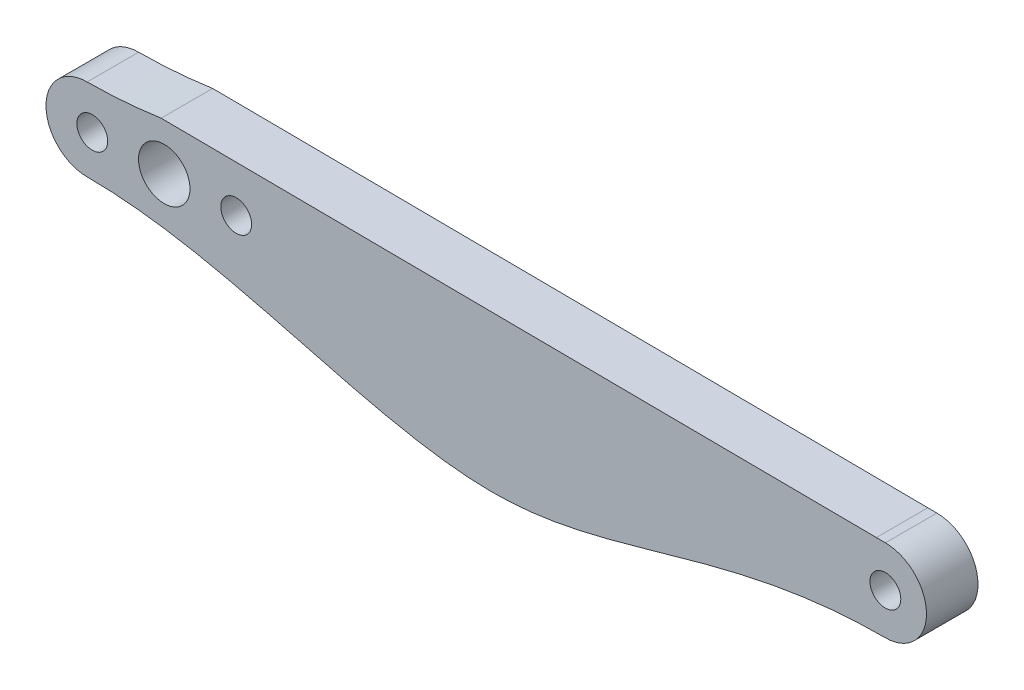
ISO-10303-21;
HEADER;
FILE_DESCRIPTION(('STEP AP214'),'2;1');
FILE_NAME('part.step','',(''),(''),'','','');
FILE_SCHEMA(('AUTOMOTIVE_DESIGN { 1 0 10303 214 1 1 1 1 }'));
ENDSEC;
DATA;
#1=APPLICATION_CONTEXT('core data for automotive mechanical design processes');
#2=APPLICATION_PROTOCOL_DEFINITION('international standard','automotive_design',2000,#1);
#3=PRODUCT_CONTEXT('',#1,'mechanical');
#4=PRODUCT('Part','Part','',(#3));
#5=PRODUCT_RELATED_PRODUCT_CATEGORY('part','',(#4));
#6=PRODUCT_DEFINITION_FORMATION('','',#4);
#7=PRODUCT_DEFINITION_CONTEXT('part definition',#1,'design');
#8=PRODUCT_DEFINITION('design','',#6,#7);
#9=PRODUCT_DEFINITION_SHAPE('','',#8);
#10=(LENGTH_UNIT() NAMED_UNIT(*) SI_UNIT(.MILLI.,.METRE.));
#11=(NAMED_UNIT(*) PLANE_ANGLE_UNIT() SI_UNIT($,.RADIAN.));
#12=(NAMED_UNIT(*) SI_UNIT($,.STERADIAN.) SOLID_ANGLE_UNIT());
#13=UNCERTAINTY_MEASURE_WITH_UNIT(LENGTH_MEASURE(1.E-05),#10,'distance_accuracy_value','');
#14=(GEOMETRIC_REPRESENTATION_CONTEXT(3) GLOBAL_UNCERTAINTY_ASSIGNED_CONTEXT((#13)) GLOBAL_UNIT_ASSIGNED_CONTEXT((#10,
#11,#12)) REPRESENTATION_CONTEXT('',''));
#15=CARTESIAN_POINT('',(0.,0.,0.));
#16=DIRECTION('',(0.,0.,1.));
#17=DIRECTION('',(1.,0.,0.));
#18=AXIS2_PLACEMENT_3D('',#15,#16,#17);
#19=CARTESIAN_POINT('',(0.,4.,5.01));
#20=CARTESIAN_POINT('',(-15.820527041139,3.99999999999999,5.01));
#21=CARTESIAN_POINT('',(-37.0419692548758,17.7090599753551,5.01));
#22=CARTESIAN_POINT('',(-63.5275616786056,4.,5.01));
#23=CARTESIAN_POINT('',(-77.64,4.,5.01));
#24=B_SPLINE_CURVE_WITH_KNOTS('',3,(#19,#20,#21,#22,#23),.UNSPECIFIED.,.F.,.F.,(4,1,4),(0.,
0.485752691256626,1.),.UNSPECIFIED.);
#25=DIRECTION('',(0.,0.,-1.));
#26=VECTOR('',#25,1.);
#27=SURFACE_OF_LINEAR_EXTRUSION('',#24,#26);
#28=CARTESIAN_POINT('',(-77.64,4.,0.));
#29=CARTESIAN_POINT('',(-63.5275616786056,4.,0.));
#30=CARTESIAN_POINT('',(-37.0419692548758,17.7090599753551,0.));
#31=CARTESIAN_POINT('',(-15.820527041139,3.99999999999999,0.));
#32=CARTESIAN_POINT('',(0.,4.,0.));
#33=B_SPLINE_CURVE_WITH_KNOTS('',3,(#28,#29,#30,#31,#32),.UNSPECIFIED.,.F.,.F.,(4,1,4),(0.,
0.514247308743374,1.),.UNSPECIFIED.);
#34=CARTESIAN_POINT('',(-0.876672071103358,4.0068201978836,0.));
#35=VERTEX_POINT('',#34);
#36=CARTESIAN_POINT('',(0.,4.,0.));
#37=VERTEX_POINT('',#36);
#38=EDGE_CURVE('E108',#35,#37,#33,.T.);
#39=ORIENTED_EDGE('',*,*,#38,.F.);
#40=DIRECTION('',(0.,0.,1.));
#41=VECTOR('',#40,1.);
#42=CARTESIAN_POINT('',(-0.876672071103358,4.0068201978836,-4.99));
#43=LINE('',#42,#41);
#44=CARTESIAN_POINT('',(-0.876672071103358,4.0068201978836,5.01));
#45=VERTEX_POINT('',#44);
#46=EDGE_CURVE('E96',#35,#45,#43,.T.);
#47=ORIENTED_EDGE('',*,*,#46,.T.);
#48=CARTESIAN_POINT('',(0.,4.,5.01));
#49=VERTEX_POINT('',#48);
#50=EDGE_CURVE('E107',#49,#45,#24,.T.);
#51=ORIENTED_EDGE('',*,*,#50,.F.);
#52=DIRECTION('',(0.,0.,-1.));
#53=VECTOR('',#52,1.);
#54=CARTESIAN_POINT('',(0.,4.,5.));
#55=LINE('',#54,#53);
#56=EDGE_CURVE('E11',#49,#37,#55,.T.);
#57=ORIENTED_EDGE('',*,*,#56,.T.);
#58=EDGE_LOOP('',(#39,#47,#51,#57));
#59=FACE_BOUND('',#58,.T.);
#60=ADVANCED_FACE('F41',(#59),#27,.F.);
#61=CARTESIAN_POINT('',(0.,0.,0.));
#62=DIRECTION('',(0.,0.,1.));
#63=DIRECTION('',(1.,0.,0.));
#64=AXIS2_PLACEMENT_3D('',#61,#62,#63);
#65=PLANE('',#64);
#66=CARTESIAN_POINT('',(-77.14,0.,0.));
#67=DIRECTION('',(0.,0.,1.));
#68=DIRECTION('',(1.,0.,0.));
#69=AXIS2_PLACEMENT_3D('',#66,#67,#68);
#70=CIRCLE('',#69,1.5);
#71=CARTESIAN_POINT('',(-75.64,0.,0.));
#72=VERTEX_POINT('',#71);
#73=EDGE_CURVE('E102',#72,#72,#70,.T.);
#74=ORIENTED_EDGE('',*,*,#73,.T.);
#75=EDGE_LOOP('',(#74));
#76=FACE_BOUND('',#75,.T.);
#77=CARTESIAN_POINT('',(-63.14,0.,0.));
#78=DIRECTION('',(0.,0.,1.));
#79=DIRECTION('',(1.,0.,0.));
#80=AXIS2_PLACEMENT_3D('',#77,#78,#79);
#81=CIRCLE('',#80,1.5);
#82=CARTESIAN_POINT('',(-61.64,0.,0.));
#83=VERTEX_POINT('',#82);
#84=EDGE_CURVE('E181',#83,#83,#81,.T.);
#85=ORIENTED_EDGE('',*,*,#84,.T.);
#86=EDGE_LOOP('',(#85));
#87=FACE_BOUND('',#86,.T.);
#88=CARTESIAN_POINT('',(-70.14,0.,0.));
#89=DIRECTION('',(0.,0.,-1.));
#90=DIRECTION('',(-1.,0.,0.));
#91=AXIS2_PLACEMENT_3D('',#88,#89,#90);
#92=CIRCLE('',#91,2.50000000000001);
#93=CARTESIAN_POINT('',(-72.64,0.,0.));
#94=VERTEX_POINT('',#93);
#95=EDGE_CURVE('E214',#94,#94,#92,.T.);
#96=ORIENTED_EDGE('',*,*,#95,.F.);
#97=EDGE_LOOP('',(#96));
#98=FACE_BOUND('',#97,.T.);
#99=CARTESIAN_POINT('',(-77.64,3.99999999999999,0.));
#100=VERTEX_POINT('',#99);
#101=CARTESIAN_POINT('',(-70.4405046091864,4.54800211697085,0.));
#102=VERTEX_POINT('',#101);
#103=EDGE_CURVE('E162',#100,#102,#33,.T.);
#104=ORIENTED_EDGE('',*,*,#103,.T.);
#105=DIRECTION('',(0.999969739934239,-0.00777940973662337,0.));
#106=VECTOR('',#105,1.);
#107=CARTESIAN_POINT('',(0.0311166973246926,3.9997579231366,0.));
#108=LINE('',#107,#106);
#109=EDGE_CURVE('E110',#102,#35,#108,.T.);
#110=ORIENTED_EDGE('',*,*,#109,.T.);
#111=ORIENTED_EDGE('',*,*,#38,.T.);
#112=CARTESIAN_POINT('',(0.,0.,0.));
#113=DIRECTION('',(0.,0.,1.));
#114=DIRECTION('',(1.,0.,0.));
#115=AXIS2_PLACEMENT_3D('',#112,#113,#114);
#116=CIRCLE('',#115,4.);
#117=CARTESIAN_POINT('',(0.,-4.,0.));
#118=VERTEX_POINT('',#117);
#119=EDGE_CURVE('E222',#118,#37,#116,.T.);
#120=ORIENTED_EDGE('',*,*,#119,.F.);
#121=CARTESIAN_POINT('',(-77.64,-4.,0.));
#122=CARTESIAN_POINT('',(-63.5275616786056,-4.,0.));
#123=CARTESIAN_POINT('',(-37.0419692548758,-17.7090599753551,0.));
#124=CARTESIAN_POINT('',(-15.820527041139,-3.99999999999999,0.));
#125=CARTESIAN_POINT('',(0.,-4.,0.));
#126=B_SPLINE_CURVE_WITH_KNOTS('',3,(#121,#122,#123,#124,#125),.UNSPECIFIED.,.F.,.F.,(4,1,4),
(0.,0.514247308743374,1.),.UNSPECIFIED.);
#127=CARTESIAN_POINT('',(-77.64,-4.00000000000001,0.));
#128=VERTEX_POINT('',#127);
#129=EDGE_CURVE('E154',#128,#118,#126,.T.);
#130=ORIENTED_EDGE('',*,*,#129,.F.);
#131=CARTESIAN_POINT('',(-77.64,0.,0.));
#132=DIRECTION('',(0.,0.,1.));
#133=DIRECTION('',(1.,0.,0.));
#134=AXIS2_PLACEMENT_3D('',#131,#132,#133);
#135=CIRCLE('',#134,4.);
#136=EDGE_CURVE('E242',#100,#128,#135,.T.);
#137=ORIENTED_EDGE('',*,*,#136,.F.);
#138=EDGE_LOOP('',(#104,#110,#111,#120,#130,#137));
#139=FACE_BOUND('',#138,.T.);
#140=CARTESIAN_POINT('',(0.,0.,0.));
#141=DIRECTION('',(0.,0.,1.));
#142=DIRECTION('',(1.,0.,0.));
#143=AXIS2_PLACEMENT_3D('',#140,#141,#142);
#144=CIRCLE('',#143,1.5);
#145=CARTESIAN_POINT('',(1.5,0.,0.));
#146=VERTEX_POINT('',#145);
#147=EDGE_CURVE('E219',#146,#146,#144,.T.);
#148=ORIENTED_EDGE('',*,*,#147,.T.);
#149=EDGE_LOOP('',(#148));
#150=FACE_BOUND('',#149,.T.);
#151=ADVANCED_FACE('F207',(#76,#87,#98,#139,#150),#65,.F.);
#152=CARTESIAN_POINT('',(0.,0.,5.));
#153=DIRECTION('',(0.,0.,-1.));
#154=DIRECTION('',(-1.,0.,0.));
#155=AXIS2_PLACEMENT_3D('',#152,#153,#154);
#156=CYLINDRICAL_SURFACE('',#155,4.);
#157=ORIENTED_EDGE('',*,*,#119,.T.);
#158=ORIENTED_EDGE('',*,*,#56,.F.);
#159=CARTESIAN_POINT('',(0.,0.,5.01));
#160=DIRECTION('',(0.,0.,1.));
#161=DIRECTION('',(1.,0.,0.));
#162=AXIS2_PLACEMENT_3D('',#159,#160,#161);
#163=CIRCLE('',#162,4.);
#164=CARTESIAN_POINT('',(0.,-4.,5.01));
#165=VERTEX_POINT('',#164);
#166=EDGE_CURVE('E117',#165,#49,#163,.T.);
#167=ORIENTED_EDGE('',*,*,#166,.F.);
#168=DIRECTION('',(0.,0.,-1.));
#169=VECTOR('',#168,1.);
#170=CARTESIAN_POINT('',(0.,-4.,5.));
#171=LINE('',#170,#169);
#172=EDGE_CURVE('E50',#165,#118,#171,.T.);
#173=ORIENTED_EDGE('',*,*,#172,.T.);
#174=EDGE_LOOP('',(#157,#158,#167,#173));
#175=FACE_BOUND('',#174,.T.);
#176=ADVANCED_FACE('F43',(#175),#156,.T.);
#177=CARTESIAN_POINT('',(0.,0.,5.));
#178=DIRECTION('',(0.,0.,-1.));
#179=DIRECTION('',(-1.,0.,0.));
#180=AXIS2_PLACEMENT_3D('',#177,#178,#179);
#181=CYLINDRICAL_SURFACE('',#180,1.5);
#182=ORIENTED_EDGE('',*,*,#147,.F.);
#183=EDGE_LOOP('',(#182));
#184=FACE_BOUND('',#183,.T.);
#185=CARTESIAN_POINT('',(0.,0.,5.01));
#186=DIRECTION('',(0.,0.,1.));
#187=DIRECTION('',(1.,0.,0.));
#188=AXIS2_PLACEMENT_3D('',#185,#186,#187);
#189=CIRCLE('',#188,1.5);
#190=CARTESIAN_POINT('',(1.5,0.,5.01));
#191=VERTEX_POINT('',#190);
#192=EDGE_CURVE('E124',#191,#191,#189,.F.);
#193=ORIENTED_EDGE('',*,*,#192,.F.);
#194=EDGE_LOOP('',(#193));
#195=FACE_BOUND('',#194,.T.);
#196=ADVANCED_FACE('F256',(#184,#195),#181,.F.);
#197=CARTESIAN_POINT('',(-77.64,0.,5.));
#198=DIRECTION('',(0.,0.,-1.));
#199=DIRECTION('',(-1.,0.,0.));
#200=AXIS2_PLACEMENT_3D('',#197,#198,#199);
#201=CYLINDRICAL_SURFACE('',#200,4.);
#202=ORIENTED_EDGE('',*,*,#136,.T.);
#203=DIRECTION('',(0.,0.,-1.));
#204=VECTOR('',#203,1.);
#205=CARTESIAN_POINT('',(-77.64,-4.,5.));
#206=LINE('',#205,#204);
#207=CARTESIAN_POINT('',(-77.64,-4.00000000000001,5.01));
#208=VERTEX_POINT('',#207);
#209=EDGE_CURVE('E65',#208,#128,#206,.T.);
#210=ORIENTED_EDGE('',*,*,#209,.F.);
#211=CARTESIAN_POINT('',(-77.64,0.,5.01));
#212=DIRECTION('',(0.,0.,1.));
#213=DIRECTION('',(1.,0.,0.));
#214=AXIS2_PLACEMENT_3D('',#211,#212,#213);
#215=CIRCLE('',#214,4.);
#216=CARTESIAN_POINT('',(-77.64,3.99999999999999,5.01));
#217=VERTEX_POINT('',#216);
#218=EDGE_CURVE('E119',#217,#208,#215,.T.);
#219=ORIENTED_EDGE('',*,*,#218,.F.);
#220=DIRECTION('',(0.,0.,-1.));
#221=VECTOR('',#220,1.);
#222=CARTESIAN_POINT('',(-77.64,4.,5.));
#223=LINE('',#222,#221);
#224=EDGE_CURVE('E223',#217,#100,#223,.T.);
#225=ORIENTED_EDGE('',*,*,#224,.T.);
#226=EDGE_LOOP('',(#202,#210,#219,#225));
#227=FACE_BOUND('',#226,.T.);
#228=ADVANCED_FACE('F258',(#227),#201,.T.);
#229=CARTESIAN_POINT('',(-70.14,0.,5.));
#230=DIRECTION('',(0.,0.,-1.));
#231=DIRECTION('',(-1.,0.,0.));
#232=AXIS2_PLACEMENT_3D('',#229,#230,#231);
#233=CYLINDRICAL_SURFACE('',#232,2.50000000000001);
#234=ORIENTED_EDGE('',*,*,#95,.T.);
#235=EDGE_LOOP('',(#234));
#236=FACE_BOUND('',#235,.T.);
#237=CARTESIAN_POINT('',(-70.14,0.,5.01));
#238=DIRECTION('',(0.,0.,1.));
#239=DIRECTION('',(1.,0.,0.));
#240=AXIS2_PLACEMENT_3D('',#237,#238,#239);
#241=CIRCLE('',#240,2.50000000000001);
#242=CARTESIAN_POINT('',(-67.64,0.,5.01));
#243=VERTEX_POINT('',#242);
#244=EDGE_CURVE('E248',#243,#243,#241,.F.);
#245=ORIENTED_EDGE('',*,*,#244,.F.);
#246=EDGE_LOOP('',(#245));
#247=FACE_BOUND('',#246,.T.);
#248=ADVANCED_FACE('F145',(#236,#247),#233,.F.);
#249=CARTESIAN_POINT('',(-77.64,-4.,5.01));
#250=CARTESIAN_POINT('',(-63.5275616786056,-4.,5.01));
#251=CARTESIAN_POINT('',(-37.0419692548758,-17.7090599753551,5.01));
#252=CARTESIAN_POINT('',(-15.820527041139,-3.99999999999999,5.01));
#253=CARTESIAN_POINT('',(0.,-4.,5.01));
#254=B_SPLINE_CURVE_WITH_KNOTS('',3,(#249,#250,#251,#252,#253),.UNSPECIFIED.,.F.,.F.,(4,1,4),
(0.,0.514247308743374,1.),.UNSPECIFIED.);
#255=DIRECTION('',(0.,0.,-1.));
#256=VECTOR('',#255,1.);
#257=SURFACE_OF_LINEAR_EXTRUSION('',#254,#256);
#258=EDGE_CURVE('E148',#208,#165,#254,.T.);
#259=ORIENTED_EDGE('',*,*,#258,.F.);
#260=ORIENTED_EDGE('',*,*,#209,.T.);
#261=ORIENTED_EDGE('',*,*,#129,.T.);
#262=ORIENTED_EDGE('',*,*,#172,.F.);
#263=EDGE_LOOP('',(#259,#260,#261,#262));
#264=FACE_BOUND('',#263,.T.);
#265=ADVANCED_FACE('F140',(#264),#257,.F.);
#266=CARTESIAN_POINT('',(-70.4405046091864,4.54800211697086,5.01));
#267=VERTEX_POINT('',#266);
#268=EDGE_CURVE('E120',#267,#217,#24,.T.);
#269=ORIENTED_EDGE('',*,*,#268,.F.);
#270=DIRECTION('',(0.,0.,1.));
#271=VECTOR('',#270,1.);
#272=CARTESIAN_POINT('',(-70.4405046091864,4.54800211697085,-4.99));
#273=LINE('',#272,#271);
#274=EDGE_CURVE('E57',#102,#267,#273,.T.);
#275=ORIENTED_EDGE('',*,*,#274,.F.);
#276=ORIENTED_EDGE('',*,*,#103,.F.);
#277=ORIENTED_EDGE('',*,*,#224,.F.);
#278=EDGE_LOOP('',(#269,#275,#276,#277));
#279=FACE_BOUND('',#278,.T.);
#280=ADVANCED_FACE('F136',(#279),#27,.F.);
#281=CARTESIAN_POINT('',(0.,0.,5.01));
#282=DIRECTION('',(0.,0.,1.));
#283=DIRECTION('',(1.,0.,0.));
#284=AXIS2_PLACEMENT_3D('',#281,#282,#283);
#285=PLANE('',#284);
#286=CARTESIAN_POINT('',(-77.14,0.,5.01));
#287=DIRECTION('',(0.,0.,1.));
#288=DIRECTION('',(1.,0.,0.));
#289=AXIS2_PLACEMENT_3D('',#286,#287,#288);
#290=CIRCLE('',#289,1.5);
#291=CARTESIAN_POINT('',(-75.64,0.,5.01));
#292=VERTEX_POINT('',#291);
#293=EDGE_CURVE('E185',#292,#292,#290,.T.);
#294=ORIENTED_EDGE('',*,*,#293,.F.);
#295=EDGE_LOOP('',(#294));
#296=FACE_BOUND('',#295,.T.);
#297=CARTESIAN_POINT('',(-63.14,0.,5.01));
#298=DIRECTION('',(0.,0.,1.));
#299=DIRECTION('',(1.,0.,0.));
#300=AXIS2_PLACEMENT_3D('',#297,#298,#299);
#301=CIRCLE('',#300,1.5);
#302=CARTESIAN_POINT('',(-61.64,0.,5.01));
#303=VERTEX_POINT('',#302);
#304=EDGE_CURVE('E186',#303,#303,#301,.T.);
#305=ORIENTED_EDGE('',*,*,#304,.F.);
#306=EDGE_LOOP('',(#305));
#307=FACE_BOUND('',#306,.T.);
#308=DIRECTION('',(0.999969739934239,-0.00777940973662337,0.));
#309=VECTOR('',#308,1.);
#310=CARTESIAN_POINT('',(0.0311166973246926,3.9997579231366,5.01));
#311=LINE('',#310,#309);
#312=EDGE_CURVE('E93',#267,#45,#311,.T.);
#313=ORIENTED_EDGE('',*,*,#312,.F.);
#314=ORIENTED_EDGE('',*,*,#268,.T.);
#315=ORIENTED_EDGE('',*,*,#218,.T.);
#316=ORIENTED_EDGE('',*,*,#258,.T.);
#317=ORIENTED_EDGE('',*,*,#166,.T.);
#318=ORIENTED_EDGE('',*,*,#50,.T.);
#319=EDGE_LOOP('',(#313,#314,#315,#316,#317,#318));
#320=FACE_BOUND('',#319,.T.);
#321=ORIENTED_EDGE('',*,*,#192,.T.);
#322=EDGE_LOOP('',(#321));
#323=FACE_BOUND('',#322,.T.);
#324=ORIENTED_EDGE('',*,*,#244,.T.);
#325=EDGE_LOOP('',(#324));
#326=FACE_BOUND('',#325,.T.);
#327=ADVANCED_FACE('F113',(#296,#307,#320,#323,#326),#285,.T.);
#328=CARTESIAN_POINT('',(0.0311166973246926,3.9997579231366,-4.99));
#329=DIRECTION('',(-0.00777940973662337,-0.999969739934239,0.));
#330=DIRECTION('',(0.999969739934239,-0.00777940973662337,0.));
#331=AXIS2_PLACEMENT_3D('',#328,#329,#330);
#332=PLANE('',#331);
#333=ORIENTED_EDGE('',*,*,#274,.T.);
#334=ORIENTED_EDGE('',*,*,#312,.T.);
#335=ORIENTED_EDGE('',*,*,#46,.F.);
#336=ORIENTED_EDGE('',*,*,#109,.F.);
#337=EDGE_LOOP('',(#333,#334,#335,#336));
#338=FACE_BOUND('',#337,.T.);
#339=ADVANCED_FACE('F95',(#338),#332,.F.);
#340=CARTESIAN_POINT('',(-63.14,0.,-4.99));
#341=DIRECTION('',(0.,0.,1.));
#342=DIRECTION('',(1.,0.,0.));
#343=AXIS2_PLACEMENT_3D('',#340,#341,#342);
#344=CYLINDRICAL_SURFACE('',#343,1.5);
#345=ORIENTED_EDGE('',*,*,#304,.T.);
#346=EDGE_LOOP('',(#345));
#347=FACE_BOUND('',#346,.T.);
#348=ORIENTED_EDGE('',*,*,#84,.F.);
#349=EDGE_LOOP('',(#348));
#350=FACE_BOUND('',#349,.T.);
#351=ADVANCED_FACE('F201',(#347,#350),#344,.F.);
#352=CARTESIAN_POINT('',(-77.14,0.,-4.99));
#353=DIRECTION('',(0.,0.,1.));
#354=DIRECTION('',(1.,0.,0.));
#355=AXIS2_PLACEMENT_3D('',#352,#353,#354);
#356=CYLINDRICAL_SURFACE('',#355,1.5);
#357=ORIENTED_EDGE('',*,*,#293,.T.);
#358=EDGE_LOOP('',(#357));
#359=FACE_BOUND('',#358,.T.);
#360=ORIENTED_EDGE('',*,*,#73,.F.);
#361=EDGE_LOOP('',(#360));
#362=FACE_BOUND('',#361,.T.);
#363=ADVANCED_FACE('F194',(#359,#362),#356,.F.);
#364=CLOSED_SHELL('',(#60,#151,#176,#196,#228,#248,#265,#280,#327,#339,#351,#363));
#365=MANIFOLD_SOLID_BREP('B2',#364);
#366=ADVANCED_BREP_SHAPE_REPRESENTATION('',(#18,#365),#14);
#367=SHAPE_DEFINITION_REPRESENTATION(#9,#366);
ENDSEC;
END-ISO-10303-21;
